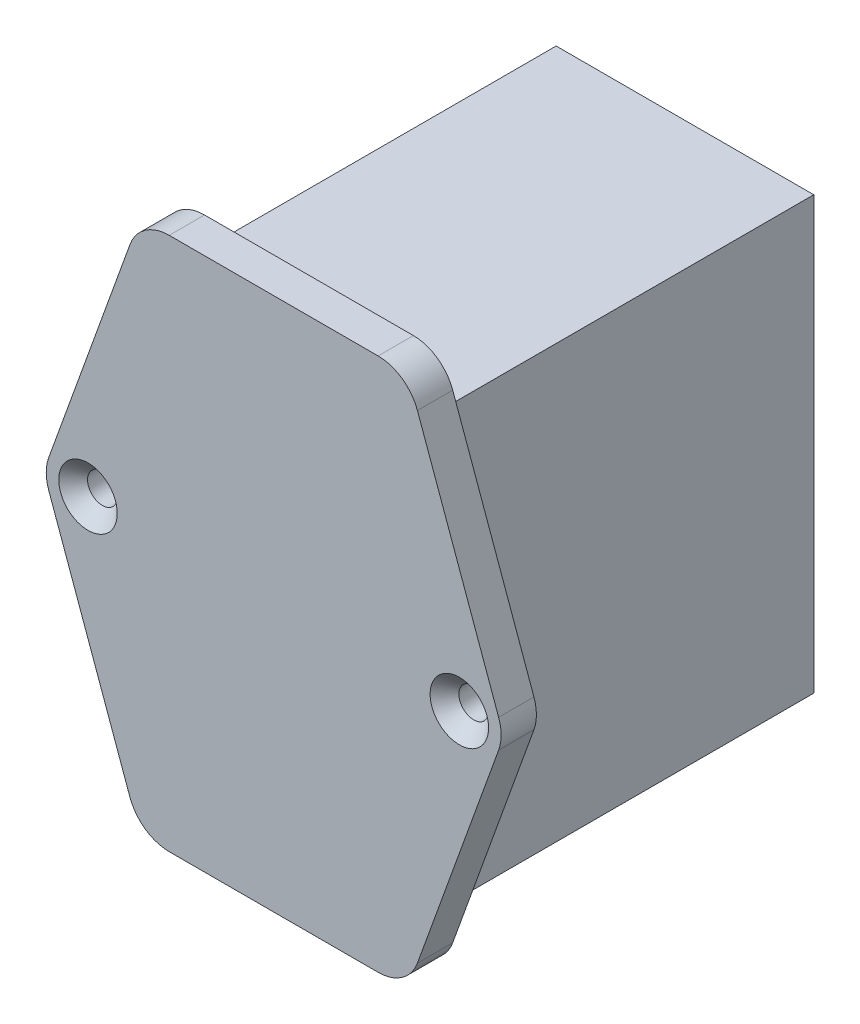
ISO-10303-21;
HEADER;
FILE_DESCRIPTION(('STEP AP214'),'2;1');
FILE_NAME('part.step','',(''),(''),'','','');
FILE_SCHEMA(('AUTOMOTIVE_DESIGN { 1 0 10303 214 1 1 1 1 }'));
ENDSEC;
DATA;
#1=APPLICATION_CONTEXT('core data for automotive mechanical design processes');
#2=APPLICATION_PROTOCOL_DEFINITION('international standard','automotive_design',2000,#1);
#3=PRODUCT_CONTEXT('',#1,'mechanical');
#4=PRODUCT('Part','Part','',(#3));
#5=PRODUCT_RELATED_PRODUCT_CATEGORY('part','',(#4));
#6=PRODUCT_DEFINITION_FORMATION('','',#4);
#7=PRODUCT_DEFINITION_CONTEXT('part definition',#1,'design');
#8=PRODUCT_DEFINITION('design','',#6,#7);
#9=PRODUCT_DEFINITION_SHAPE('','',#8);
#10=(LENGTH_UNIT() NAMED_UNIT(*) SI_UNIT(.MILLI.,.METRE.));
#11=(NAMED_UNIT(*) PLANE_ANGLE_UNIT() SI_UNIT($,.RADIAN.));
#12=(NAMED_UNIT(*) SI_UNIT($,.STERADIAN.) SOLID_ANGLE_UNIT());
#13=UNCERTAINTY_MEASURE_WITH_UNIT(LENGTH_MEASURE(1.E-05),#10,'distance_accuracy_value','');
#14=(GEOMETRIC_REPRESENTATION_CONTEXT(3) GLOBAL_UNCERTAINTY_ASSIGNED_CONTEXT((#13)) GLOBAL_UNIT_ASSIGNED_CONTEXT((#10,
#11,#12)) REPRESENTATION_CONTEXT('',''));
#15=CARTESIAN_POINT('',(0.,0.,0.));
#16=DIRECTION('',(0.,0.,1.));
#17=DIRECTION('',(1.,0.,0.));
#18=AXIS2_PLACEMENT_3D('',#15,#16,#17);
#19=CARTESIAN_POINT('',(-6.125,23.55,44.3));
#20=DIRECTION('',(0.,0.,-1.));
#21=DIRECTION('',(-1.,0.,0.));
#22=AXIS2_PLACEMENT_3D('',#19,#20,#21);
#23=CYLINDRICAL_SURFACE('',#22,1.6);
#24=CARTESIAN_POINT('',(-6.125,23.55,40.5));
#25=DIRECTION('',(0.,0.,1.));
#26=DIRECTION('',(1.,0.,0.));
#27=AXIS2_PLACEMENT_3D('',#24,#25,#26);
#28=CIRCLE('',#27,1.6);
#29=CARTESIAN_POINT('',(-4.525,23.55,40.5));
#30=VERTEX_POINT('',#29);
#31=EDGE_CURVE('E271',#30,#30,#28,.T.);
#32=ORIENTED_EDGE('',*,*,#31,.F.);
#33=EDGE_LOOP('',(#32));
#34=FACE_BOUND('',#33,.T.);
#35=CARTESIAN_POINT('',(-6.125,23.55,42.75));
#36=DIRECTION('',(0.,0.,1.));
#37=DIRECTION('',(1.,0.,0.));
#38=AXIS2_PLACEMENT_3D('',#35,#36,#37);
#39=CIRCLE('',#38,1.6);
#40=CARTESIAN_POINT('',(-4.525,23.55,42.75));
#41=VERTEX_POINT('',#40);
#42=EDGE_CURVE('E255',#41,#41,#39,.T.);
#43=ORIENTED_EDGE('',*,*,#42,.T.);
#44=EDGE_LOOP('',(#43));
#45=FACE_BOUND('',#44,.T.);
#46=ADVANCED_FACE('F35',(#34,#45),#23,.F.);
#47=CARTESIAN_POINT('',(0.,0.,40.5));
#48=DIRECTION('',(1.,0.,0.));
#49=DIRECTION('',(0.,0.,-1.));
#50=AXIS2_PLACEMENT_3D('',#47,#48,#49);
#51=PLANE('',#50);
#52=DIRECTION('',(0.,-1.,0.));
#53=VECTOR('',#52,1.);
#54=CARTESIAN_POINT('',(0.,0.,0.));
#55=LINE('',#54,#53);
#56=CARTESIAN_POINT('',(0.,46.5,0.));
#57=VERTEX_POINT('',#56);
#58=CARTESIAN_POINT('',(0.,0.,0.));
#59=VERTEX_POINT('',#58);
#60=EDGE_CURVE('E182',#57,#59,#55,.T.);
#61=ORIENTED_EDGE('',*,*,#60,.T.);
#62=DIRECTION('',(0.,0.,-1.));
#63=VECTOR('',#62,1.);
#64=CARTESIAN_POINT('',(0.,0.,40.5));
#65=LINE('',#64,#63);
#66=CARTESIAN_POINT('',(0.,0.,40.5));
#67=VERTEX_POINT('',#66);
#68=EDGE_CURVE('E11',#67,#59,#65,.T.);
#69=ORIENTED_EDGE('',*,*,#68,.F.);
#70=DIRECTION('',(0.,-1.,0.));
#71=VECTOR('',#70,1.);
#72=CARTESIAN_POINT('',(0.,0.,40.5));
#73=LINE('',#72,#71);
#74=CARTESIAN_POINT('',(0.,46.5,40.5));
#75=VERTEX_POINT('',#74);
#76=EDGE_CURVE('E191',#75,#67,#73,.T.);
#77=ORIENTED_EDGE('',*,*,#76,.F.);
#78=DIRECTION('',(0.,0.,-1.));
#79=VECTOR('',#78,1.);
#80=CARTESIAN_POINT('',(0.,46.5,40.5));
#81=LINE('',#80,#79);
#82=EDGE_CURVE('E200',#75,#57,#81,.T.);
#83=ORIENTED_EDGE('',*,*,#82,.T.);
#84=EDGE_LOOP('',(#61,#69,#77,#83));
#85=FACE_BOUND('',#84,.T.);
#86=ADVANCED_FACE('F37',(#85),#51,.F.);
#87=CARTESIAN_POINT('',(0.,0.,40.5));
#88=DIRECTION('',(0.,1.,0.));
#89=DIRECTION('',(0.,0.,1.));
#90=AXIS2_PLACEMENT_3D('',#87,#88,#89);
#91=PLANE('',#90);
#92=DIRECTION('',(1.,0.,0.));
#93=VECTOR('',#92,1.);
#94=CARTESIAN_POINT('',(0.,0.,0.));
#95=LINE('',#94,#93);
#96=CARTESIAN_POINT('',(27.75,0.,0.));
#97=VERTEX_POINT('',#96);
#98=EDGE_CURVE('E185',#59,#97,#95,.T.);
#99=ORIENTED_EDGE('',*,*,#98,.T.);
#100=DIRECTION('',(0.,0.,-1.));
#101=VECTOR('',#100,1.);
#102=CARTESIAN_POINT('',(27.75,0.,40.5));
#103=LINE('',#102,#101);
#104=CARTESIAN_POINT('',(27.75,0.,40.5));
#105=VERTEX_POINT('',#104);
#106=EDGE_CURVE('E44',#105,#97,#103,.T.);
#107=ORIENTED_EDGE('',*,*,#106,.F.);
#108=DIRECTION('',(1.,0.,0.));
#109=VECTOR('',#108,1.);
#110=CARTESIAN_POINT('',(0.,0.,40.5));
#111=LINE('',#110,#109);
#112=EDGE_CURVE('E78',#67,#105,#111,.T.);
#113=ORIENTED_EDGE('',*,*,#112,.F.);
#114=ORIENTED_EDGE('',*,*,#68,.T.);
#115=EDGE_LOOP('',(#99,#107,#113,#114));
#116=FACE_BOUND('',#115,.T.);
#117=ADVANCED_FACE('F234',(#116),#91,.F.);
#118=CARTESIAN_POINT('',(27.75,0.,40.5));
#119=DIRECTION('',(-1.,0.,0.));
#120=DIRECTION('',(0.,0.,1.));
#121=AXIS2_PLACEMENT_3D('',#118,#119,#120);
#122=PLANE('',#121);
#123=DIRECTION('',(0.,1.,0.));
#124=VECTOR('',#123,1.);
#125=CARTESIAN_POINT('',(27.75,0.,0.));
#126=LINE('',#125,#124);
#127=CARTESIAN_POINT('',(27.75,46.5,0.));
#128=VERTEX_POINT('',#127);
#129=EDGE_CURVE('E68',#97,#128,#126,.T.);
#130=ORIENTED_EDGE('',*,*,#129,.T.);
#131=DIRECTION('',(0.,0.,-1.));
#132=VECTOR('',#131,1.);
#133=CARTESIAN_POINT('',(27.75,46.5,40.5));
#134=LINE('',#133,#132);
#135=CARTESIAN_POINT('',(27.75,46.5,40.5));
#136=VERTEX_POINT('',#135);
#137=EDGE_CURVE('E52',#136,#128,#134,.T.);
#138=ORIENTED_EDGE('',*,*,#137,.F.);
#139=DIRECTION('',(0.,1.,0.));
#140=VECTOR('',#139,1.);
#141=CARTESIAN_POINT('',(27.75,0.,40.5));
#142=LINE('',#141,#140);
#143=EDGE_CURVE('E195',#105,#136,#142,.T.);
#144=ORIENTED_EDGE('',*,*,#143,.F.);
#145=ORIENTED_EDGE('',*,*,#106,.T.);
#146=EDGE_LOOP('',(#130,#138,#144,#145));
#147=FACE_BOUND('',#146,.T.);
#148=ADVANCED_FACE('F206',(#147),#122,.F.);
#149=CARTESIAN_POINT('',(0.,46.5,40.5));
#150=DIRECTION('',(0.,-1.,0.));
#151=DIRECTION('',(0.,0.,-1.));
#152=AXIS2_PLACEMENT_3D('',#149,#150,#151);
#153=PLANE('',#152);
#154=DIRECTION('',(-1.,0.,0.));
#155=VECTOR('',#154,1.);
#156=CARTESIAN_POINT('',(0.,46.5,0.));
#157=LINE('',#156,#155);
#158=EDGE_CURVE('E73',#128,#57,#157,.T.);
#159=ORIENTED_EDGE('',*,*,#158,.T.);
#160=ORIENTED_EDGE('',*,*,#82,.F.);
#161=DIRECTION('',(-1.,0.,0.));
#162=VECTOR('',#161,1.);
#163=CARTESIAN_POINT('',(0.,46.5,40.5));
#164=LINE('',#163,#162);
#165=EDGE_CURVE('E198',#136,#75,#164,.T.);
#166=ORIENTED_EDGE('',*,*,#165,.F.);
#167=ORIENTED_EDGE('',*,*,#137,.T.);
#168=EDGE_LOOP('',(#159,#160,#166,#167));
#169=FACE_BOUND('',#168,.T.);
#170=ADVANCED_FACE('F211',(#169),#153,.F.);
#171=CARTESIAN_POINT('',(0.,0.,0.));
#172=DIRECTION('',(0.,0.,-1.));
#173=DIRECTION('',(-1.,0.,0.));
#174=AXIS2_PLACEMENT_3D('',#171,#172,#173);
#175=PLANE('',#174);
#176=ORIENTED_EDGE('',*,*,#60,.F.);
#177=ORIENTED_EDGE('',*,*,#158,.F.);
#178=ORIENTED_EDGE('',*,*,#129,.F.);
#179=ORIENTED_EDGE('',*,*,#98,.F.);
#180=EDGE_LOOP('',(#176,#177,#178,#179));
#181=FACE_BOUND('',#180,.T.);
#182=ADVANCED_FACE('F209',(#181),#175,.T.);
#183=CARTESIAN_POINT('',(33.875,23.55,40.5));
#184=DIRECTION('',(0.,0.,1.));
#185=DIRECTION('',(1.,0.,0.));
#186=AXIS2_PLACEMENT_3D('',#183,#184,#185);
#187=PLANE('',#186);
#188=CARTESIAN_POINT('',(33.875,23.55,40.5));
#189=DIRECTION('',(0.,0.,1.));
#190=DIRECTION('',(1.,0.,0.));
#191=AXIS2_PLACEMENT_3D('',#188,#189,#190);
#192=CIRCLE('',#191,4.5);
#193=CARTESIAN_POINT('',(38.1078796435891,22.0226722935503,40.5));
#194=VERTEX_POINT('',#193);
#195=CARTESIAN_POINT('',(38.1078796435891,25.0773277064497,40.5));
#196=VERTEX_POINT('',#195);
#197=EDGE_CURVE('E181',#194,#196,#192,.T.);
#198=ORIENTED_EDGE('',*,*,#197,.F.);
#199=DIRECTION('',(0.339406156988818,0.940639920797582,0.));
#200=VECTOR('',#199,1.);
#201=CARTESIAN_POINT('',(29.3578796435891,-2.22732770644969,40.5));
#202=LINE('',#201,#200);
#203=CARTESIAN_POINT('',(29.3578796435891,-2.22732770644969,40.5));
#204=VERTEX_POINT('',#203);
#205=EDGE_CURVE('E177',#204,#194,#202,.T.);
#206=ORIENTED_EDGE('',*,*,#205,.F.);
#207=CARTESIAN_POINT('',(25.125,-0.700000000000004,40.5));
#208=DIRECTION('',(0.,0.,1.));
#209=DIRECTION('',(1.,0.,0.));
#210=AXIS2_PLACEMENT_3D('',#207,#208,#209);
#211=CIRCLE('',#210,4.5);
#212=CARTESIAN_POINT('',(25.125,-5.2,40.5));
#213=VERTEX_POINT('',#212);
#214=EDGE_CURVE('E312',#213,#204,#211,.T.);
#215=ORIENTED_EDGE('',*,*,#214,.F.);
#216=DIRECTION('',(1.,0.,0.));
#217=VECTOR('',#216,1.);
#218=CARTESIAN_POINT('',(2.625,-5.2,40.5));
#219=LINE('',#218,#217);
#220=CARTESIAN_POINT('',(2.625,-5.2,40.5));
#221=VERTEX_POINT('',#220);
#222=EDGE_CURVE('E310',#221,#213,#219,.T.);
#223=ORIENTED_EDGE('',*,*,#222,.F.);
#224=CARTESIAN_POINT('',(2.625,-0.700000000000004,40.5));
#225=DIRECTION('',(0.,0.,1.));
#226=DIRECTION('',(-1.,0.,0.));
#227=AXIS2_PLACEMENT_3D('',#224,#225,#226);
#228=CIRCLE('',#227,4.5);
#229=CARTESIAN_POINT('',(-1.60787964358912,-2.22732770644969,40.5));
#230=VERTEX_POINT('',#229);
#231=EDGE_CURVE('E308',#230,#221,#228,.T.);
#232=ORIENTED_EDGE('',*,*,#231,.F.);
#233=DIRECTION('',(0.339406156988818,-0.940639920797582,0.));
#234=VECTOR('',#233,1.);
#235=CARTESIAN_POINT('',(-10.3578796435891,22.0226722935503,40.5));
#236=LINE('',#235,#234);
#237=CARTESIAN_POINT('',(-10.3578796435891,22.0226722935503,40.5));
#238=VERTEX_POINT('',#237);
#239=EDGE_CURVE('E306',#238,#230,#236,.T.);
#240=ORIENTED_EDGE('',*,*,#239,.F.);
#241=CARTESIAN_POINT('',(-6.125,23.55,40.5));
#242=DIRECTION('',(0.,0.,1.));
#243=DIRECTION('',(1.,0.,0.));
#244=AXIS2_PLACEMENT_3D('',#241,#242,#243);
#245=CIRCLE('',#244,4.5);
#246=CARTESIAN_POINT('',(-10.3578796435891,25.0773277064497,40.5));
#247=VERTEX_POINT('',#246);
#248=EDGE_CURVE('E304',#247,#238,#245,.T.);
#249=ORIENTED_EDGE('',*,*,#248,.F.);
#250=DIRECTION('',(-0.339406156988818,-0.940639920797582,0.));
#251=VECTOR('',#250,1.);
#252=CARTESIAN_POINT('',(-1.60787964358912,49.3273277064497,40.5));
#253=LINE('',#252,#251);
#254=CARTESIAN_POINT('',(-1.60787964358912,49.3273277064497,40.5));
#255=VERTEX_POINT('',#254);
#256=EDGE_CURVE('E302',#255,#247,#253,.T.);
#257=ORIENTED_EDGE('',*,*,#256,.F.);
#258=CARTESIAN_POINT('',(2.625,47.8,40.5));
#259=DIRECTION('',(0.,0.,1.));
#260=DIRECTION('',(1.,0.,0.));
#261=AXIS2_PLACEMENT_3D('',#258,#259,#260);
#262=CIRCLE('',#261,4.5);
#263=CARTESIAN_POINT('',(2.625,52.3,40.5));
#264=VERTEX_POINT('',#263);
#265=EDGE_CURVE('E300',#264,#255,#262,.T.);
#266=ORIENTED_EDGE('',*,*,#265,.F.);
#267=DIRECTION('',(-1.,0.,0.));
#268=VECTOR('',#267,1.);
#269=CARTESIAN_POINT('',(25.125,52.3,40.5));
#270=LINE('',#269,#268);
#271=CARTESIAN_POINT('',(25.125,52.3,40.5));
#272=VERTEX_POINT('',#271);
#273=EDGE_CURVE('E298',#272,#264,#270,.T.);
#274=ORIENTED_EDGE('',*,*,#273,.F.);
#275=CARTESIAN_POINT('',(25.125,47.8,40.5));
#276=DIRECTION('',(0.,0.,1.));
#277=DIRECTION('',(-1.,0.,0.));
#278=AXIS2_PLACEMENT_3D('',#275,#276,#277);
#279=CIRCLE('',#278,4.5);
#280=CARTESIAN_POINT('',(29.3578796435891,49.3273277064497,40.5));
#281=VERTEX_POINT('',#280);
#282=EDGE_CURVE('E296',#281,#272,#279,.T.);
#283=ORIENTED_EDGE('',*,*,#282,.F.);
#284=DIRECTION('',(-0.339406156988818,0.940639920797582,0.));
#285=VECTOR('',#284,1.);
#286=CARTESIAN_POINT('',(38.1078796435891,25.0773277064497,40.5));
#287=LINE('',#286,#285);
#288=EDGE_CURVE('E294',#196,#281,#287,.T.);
#289=ORIENTED_EDGE('',*,*,#288,.F.);
#290=EDGE_LOOP('',(#198,#206,#215,#223,#232,#240,#249,#257,#266,#274,#283,#289));
#291=FACE_BOUND('',#290,.T.);
#292=ORIENTED_EDGE('',*,*,#31,.T.);
#293=EDGE_LOOP('',(#292));
#294=FACE_BOUND('',#293,.T.);
#295=CARTESIAN_POINT('',(33.875,23.55,40.5));
#296=DIRECTION('',(0.,0.,1.));
#297=DIRECTION('',(1.,0.,0.));
#298=AXIS2_PLACEMENT_3D('',#295,#296,#297);
#299=CIRCLE('',#298,1.6);
#300=CARTESIAN_POINT('',(35.475,23.55,40.5));
#301=VERTEX_POINT('',#300);
#302=EDGE_CURVE('E268',#301,#301,#299,.T.);
#303=ORIENTED_EDGE('',*,*,#302,.T.);
#304=EDGE_LOOP('',(#303));
#305=FACE_BOUND('',#304,.T.);
#306=ORIENTED_EDGE('',*,*,#165,.T.);
#307=ORIENTED_EDGE('',*,*,#76,.T.);
#308=ORIENTED_EDGE('',*,*,#112,.T.);
#309=ORIENTED_EDGE('',*,*,#143,.T.);
#310=EDGE_LOOP('',(#306,#307,#308,#309));
#311=FACE_BOUND('',#310,.T.);
#312=ADVANCED_FACE('F213',(#291,#294,#305,#311),#187,.F.);
#313=CARTESIAN_POINT('',(33.875,23.55,44.3));
#314=DIRECTION('',(0.,0.,1.));
#315=DIRECTION('',(1.,0.,0.));
#316=AXIS2_PLACEMENT_3D('',#313,#314,#315);
#317=PLANE('',#316);
#318=CARTESIAN_POINT('',(-6.125,23.55,44.3));
#319=DIRECTION('',(0.,0.,1.));
#320=DIRECTION('',(1.,0.,0.));
#321=AXIS2_PLACEMENT_3D('',#318,#319,#320);
#322=CIRCLE('',#321,3.15);
#323=CARTESIAN_POINT('',(-2.975,23.55,44.3));
#324=VERTEX_POINT('',#323);
#325=EDGE_CURVE('E258',#324,#324,#322,.T.);
#326=ORIENTED_EDGE('',*,*,#325,.F.);
#327=EDGE_LOOP('',(#326));
#328=FACE_BOUND('',#327,.T.);
#329=CARTESIAN_POINT('',(33.875,23.55,44.3));
#330=DIRECTION('',(0.,0.,1.));
#331=DIRECTION('',(1.,0.,0.));
#332=AXIS2_PLACEMENT_3D('',#329,#330,#331);
#333=CIRCLE('',#332,3.15);
#334=CARTESIAN_POINT('',(37.025,23.55,44.3));
#335=VERTEX_POINT('',#334);
#336=EDGE_CURVE('E260',#335,#335,#333,.T.);
#337=ORIENTED_EDGE('',*,*,#336,.F.);
#338=EDGE_LOOP('',(#337));
#339=FACE_BOUND('',#338,.T.);
#340=CARTESIAN_POINT('',(33.875,23.55,44.3));
#341=DIRECTION('',(0.,0.,1.));
#342=DIRECTION('',(1.,0.,0.));
#343=AXIS2_PLACEMENT_3D('',#340,#341,#342);
#344=CIRCLE('',#343,4.5);
#345=CARTESIAN_POINT('',(38.1078796435891,22.0226722935503,44.3));
#346=VERTEX_POINT('',#345);
#347=CARTESIAN_POINT('',(38.1078796435891,25.0773277064497,44.3));
#348=VERTEX_POINT('',#347);
#349=EDGE_CURVE('E168',#346,#348,#344,.T.);
#350=ORIENTED_EDGE('',*,*,#349,.T.);
#351=DIRECTION('',(-0.339406156988818,0.940639920797582,0.));
#352=VECTOR('',#351,1.);
#353=CARTESIAN_POINT('',(38.1078796435891,25.0773277064497,44.3));
#354=LINE('',#353,#352);
#355=CARTESIAN_POINT('',(29.3578796435891,49.3273277064497,44.3));
#356=VERTEX_POINT('',#355);
#357=EDGE_CURVE('E157',#348,#356,#354,.T.);
#358=ORIENTED_EDGE('',*,*,#357,.T.);
#359=CARTESIAN_POINT('',(25.125,47.8,44.3));
#360=DIRECTION('',(0.,0.,1.));
#361=DIRECTION('',(-1.,0.,0.));
#362=AXIS2_PLACEMENT_3D('',#359,#360,#361);
#363=CIRCLE('',#362,4.5);
#364=CARTESIAN_POINT('',(25.125,52.3,44.3));
#365=VERTEX_POINT('',#364);
#366=EDGE_CURVE('E167',#356,#365,#363,.T.);
#367=ORIENTED_EDGE('',*,*,#366,.T.);
#368=DIRECTION('',(-1.,0.,0.));
#369=VECTOR('',#368,1.);
#370=CARTESIAN_POINT('',(25.125,52.3,44.3));
#371=LINE('',#370,#369);
#372=CARTESIAN_POINT('',(2.625,52.3,44.3));
#373=VERTEX_POINT('',#372);
#374=EDGE_CURVE('E275',#365,#373,#371,.T.);
#375=ORIENTED_EDGE('',*,*,#374,.T.);
#376=CARTESIAN_POINT('',(2.625,47.8,44.3));
#377=DIRECTION('',(0.,0.,1.));
#378=DIRECTION('',(1.,0.,0.));
#379=AXIS2_PLACEMENT_3D('',#376,#377,#378);
#380=CIRCLE('',#379,4.5);
#381=CARTESIAN_POINT('',(-1.60787964358912,49.3273277064497,44.3));
#382=VERTEX_POINT('',#381);
#383=EDGE_CURVE('E277',#373,#382,#380,.T.);
#384=ORIENTED_EDGE('',*,*,#383,.T.);
#385=DIRECTION('',(-0.339406156988818,-0.940639920797582,0.));
#386=VECTOR('',#385,1.);
#387=CARTESIAN_POINT('',(-1.60787964358912,49.3273277064497,44.3));
#388=LINE('',#387,#386);
#389=CARTESIAN_POINT('',(-10.3578796435891,25.0773277064497,44.3));
#390=VERTEX_POINT('',#389);
#391=EDGE_CURVE('E279',#382,#390,#388,.T.);
#392=ORIENTED_EDGE('',*,*,#391,.T.);
#393=CARTESIAN_POINT('',(-6.125,23.55,44.3));
#394=DIRECTION('',(0.,0.,1.));
#395=DIRECTION('',(1.,0.,0.));
#396=AXIS2_PLACEMENT_3D('',#393,#394,#395);
#397=CIRCLE('',#396,4.5);
#398=CARTESIAN_POINT('',(-10.3578796435891,22.0226722935503,44.3));
#399=VERTEX_POINT('',#398);
#400=EDGE_CURVE('E281',#390,#399,#397,.T.);
#401=ORIENTED_EDGE('',*,*,#400,.T.);
#402=DIRECTION('',(0.339406156988818,-0.940639920797582,0.));
#403=VECTOR('',#402,1.);
#404=CARTESIAN_POINT('',(-10.3578796435891,22.0226722935503,44.3));
#405=LINE('',#404,#403);
#406=CARTESIAN_POINT('',(-1.60787964358912,-2.22732770644969,44.3));
#407=VERTEX_POINT('',#406);
#408=EDGE_CURVE('E283',#399,#407,#405,.T.);
#409=ORIENTED_EDGE('',*,*,#408,.T.);
#410=CARTESIAN_POINT('',(2.625,-0.700000000000004,44.3));
#411=DIRECTION('',(0.,0.,1.));
#412=DIRECTION('',(-1.,0.,0.));
#413=AXIS2_PLACEMENT_3D('',#410,#411,#412);
#414=CIRCLE('',#413,4.5);
#415=CARTESIAN_POINT('',(2.625,-5.2,44.3));
#416=VERTEX_POINT('',#415);
#417=EDGE_CURVE('E285',#407,#416,#414,.T.);
#418=ORIENTED_EDGE('',*,*,#417,.T.);
#419=DIRECTION('',(1.,0.,0.));
#420=VECTOR('',#419,1.);
#421=CARTESIAN_POINT('',(2.625,-5.2,44.3));
#422=LINE('',#421,#420);
#423=CARTESIAN_POINT('',(25.125,-5.2,44.3));
#424=VERTEX_POINT('',#423);
#425=EDGE_CURVE('E287',#416,#424,#422,.T.);
#426=ORIENTED_EDGE('',*,*,#425,.T.);
#427=CARTESIAN_POINT('',(25.125,-0.700000000000004,44.3));
#428=DIRECTION('',(0.,0.,1.));
#429=DIRECTION('',(1.,0.,0.));
#430=AXIS2_PLACEMENT_3D('',#427,#428,#429);
#431=CIRCLE('',#430,4.5);
#432=CARTESIAN_POINT('',(29.3578796435891,-2.22732770644969,44.3));
#433=VERTEX_POINT('',#432);
#434=EDGE_CURVE('E289',#424,#433,#431,.T.);
#435=ORIENTED_EDGE('',*,*,#434,.T.);
#436=DIRECTION('',(0.339406156988818,0.940639920797582,0.));
#437=VECTOR('',#436,1.);
#438=CARTESIAN_POINT('',(29.3578796435891,-2.22732770644969,44.3));
#439=LINE('',#438,#437);
#440=EDGE_CURVE('E173',#433,#346,#439,.T.);
#441=ORIENTED_EDGE('',*,*,#440,.T.);
#442=EDGE_LOOP('',(#350,#358,#367,#375,#384,#392,#401,#409,#418,#426,#435,#441));
#443=FACE_BOUND('',#442,.T.);
#444=ADVANCED_FACE('F171',(#328,#339,#443),#317,.T.);
#445=CARTESIAN_POINT('',(33.875,23.55,44.3));
#446=DIRECTION('',(0.,0.,-1.));
#447=DIRECTION('',(-1.,0.,0.));
#448=AXIS2_PLACEMENT_3D('',#445,#446,#447);
#449=CYLINDRICAL_SURFACE('',#448,4.5);
#450=ORIENTED_EDGE('',*,*,#197,.T.);
#451=DIRECTION('',(0.,0.,-1.));
#452=VECTOR('',#451,1.);
#453=CARTESIAN_POINT('',(38.1078796435891,25.0773277064497,44.3));
#454=LINE('',#453,#452);
#455=EDGE_CURVE('E161',#348,#196,#454,.T.);
#456=ORIENTED_EDGE('',*,*,#455,.F.);
#457=ORIENTED_EDGE('',*,*,#349,.F.);
#458=DIRECTION('',(0.,0.,-1.));
#459=VECTOR('',#458,1.);
#460=CARTESIAN_POINT('',(38.1078796435891,22.0226722935503,44.3));
#461=LINE('',#460,#459);
#462=EDGE_CURVE('E292',#346,#194,#461,.T.);
#463=ORIENTED_EDGE('',*,*,#462,.T.);
#464=EDGE_LOOP('',(#450,#456,#457,#463));
#465=FACE_BOUND('',#464,.T.);
#466=ADVANCED_FACE('F179',(#465),#449,.T.);
#467=CARTESIAN_POINT('',(38.1078796435891,25.0773277064497,44.3));
#468=DIRECTION('',(-0.940639920797582,-0.339406156988818,0.));
#469=DIRECTION('',(0.339406156988818,-0.940639920797582,0.));
#470=AXIS2_PLACEMENT_3D('',#467,#468,#469);
#471=PLANE('',#470);
#472=ORIENTED_EDGE('',*,*,#288,.T.);
#473=DIRECTION('',(0.,0.,-1.));
#474=VECTOR('',#473,1.);
#475=CARTESIAN_POINT('',(29.3578796435891,49.3273277064497,44.3));
#476=LINE('',#475,#474);
#477=EDGE_CURVE('E164',#356,#281,#476,.T.);
#478=ORIENTED_EDGE('',*,*,#477,.F.);
#479=ORIENTED_EDGE('',*,*,#357,.F.);
#480=ORIENTED_EDGE('',*,*,#455,.T.);
#481=EDGE_LOOP('',(#472,#478,#479,#480));
#482=FACE_BOUND('',#481,.T.);
#483=ADVANCED_FACE('F159',(#482),#471,.F.);
#484=CARTESIAN_POINT('',(25.125,47.8,44.3));
#485=DIRECTION('',(0.,0.,-1.));
#486=DIRECTION('',(-1.,0.,0.));
#487=AXIS2_PLACEMENT_3D('',#484,#485,#486);
#488=CYLINDRICAL_SURFACE('',#487,4.5);
#489=ORIENTED_EDGE('',*,*,#282,.T.);
#490=DIRECTION('',(0.,0.,-1.));
#491=VECTOR('',#490,1.);
#492=CARTESIAN_POINT('',(25.125,52.3,44.3));
#493=LINE('',#492,#491);
#494=EDGE_CURVE('E187',#365,#272,#493,.T.);
#495=ORIENTED_EDGE('',*,*,#494,.F.);
#496=ORIENTED_EDGE('',*,*,#366,.F.);
#497=ORIENTED_EDGE('',*,*,#477,.T.);
#498=EDGE_LOOP('',(#489,#495,#496,#497));
#499=FACE_BOUND('',#498,.T.);
#500=ADVANCED_FACE('F361',(#499),#488,.T.);
#501=CARTESIAN_POINT('',(25.125,52.3,44.3));
#502=DIRECTION('',(0.,-1.,0.));
#503=DIRECTION('',(1.,0.,0.));
#504=AXIS2_PLACEMENT_3D('',#501,#502,#503);
#505=PLANE('',#504);
#506=ORIENTED_EDGE('',*,*,#273,.T.);
#507=DIRECTION('',(0.,0.,-1.));
#508=VECTOR('',#507,1.);
#509=CARTESIAN_POINT('',(2.625,52.3,44.3));
#510=LINE('',#509,#508);
#511=EDGE_CURVE('E337',#373,#264,#510,.T.);
#512=ORIENTED_EDGE('',*,*,#511,.F.);
#513=ORIENTED_EDGE('',*,*,#374,.F.);
#514=ORIENTED_EDGE('',*,*,#494,.T.);
#515=EDGE_LOOP('',(#506,#512,#513,#514));
#516=FACE_BOUND('',#515,.T.);
#517=ADVANCED_FACE('F344',(#516),#505,.F.);
#518=CARTESIAN_POINT('',(2.625,47.8,44.3));
#519=DIRECTION('',(0.,0.,-1.));
#520=DIRECTION('',(-1.,0.,0.));
#521=AXIS2_PLACEMENT_3D('',#518,#519,#520);
#522=CYLINDRICAL_SURFACE('',#521,4.5);
#523=ORIENTED_EDGE('',*,*,#265,.T.);
#524=DIRECTION('',(0.,0.,-1.));
#525=VECTOR('',#524,1.);
#526=CARTESIAN_POINT('',(-1.60787964358912,49.3273277064497,44.3));
#527=LINE('',#526,#525);
#528=EDGE_CURVE('E334',#382,#255,#527,.T.);
#529=ORIENTED_EDGE('',*,*,#528,.F.);
#530=ORIENTED_EDGE('',*,*,#383,.F.);
#531=ORIENTED_EDGE('',*,*,#511,.T.);
#532=EDGE_LOOP('',(#523,#529,#530,#531));
#533=FACE_BOUND('',#532,.T.);
#534=ADVANCED_FACE('F353',(#533),#522,.T.);
#535=CARTESIAN_POINT('',(-1.60787964358912,49.3273277064497,44.3));
#536=DIRECTION('',(0.940639920797582,-0.339406156988818,0.));
#537=DIRECTION('',(0.339406156988818,0.940639920797582,0.));
#538=AXIS2_PLACEMENT_3D('',#535,#536,#537);
#539=PLANE('',#538);
#540=ORIENTED_EDGE('',*,*,#256,.T.);
#541=DIRECTION('',(0.,0.,-1.));
#542=VECTOR('',#541,1.);
#543=CARTESIAN_POINT('',(-10.3578796435891,25.0773277064497,44.3));
#544=LINE('',#543,#542);
#545=EDGE_CURVE('E331',#390,#247,#544,.T.);
#546=ORIENTED_EDGE('',*,*,#545,.F.);
#547=ORIENTED_EDGE('',*,*,#391,.F.);
#548=ORIENTED_EDGE('',*,*,#528,.T.);
#549=EDGE_LOOP('',(#540,#546,#547,#548));
#550=FACE_BOUND('',#549,.T.);
#551=ADVANCED_FACE('F357',(#550),#539,.F.);
#552=CARTESIAN_POINT('',(-6.125,23.55,44.3));
#553=DIRECTION('',(0.,0.,-1.));
#554=DIRECTION('',(-1.,0.,0.));
#555=AXIS2_PLACEMENT_3D('',#552,#553,#554);
#556=CYLINDRICAL_SURFACE('',#555,4.5);
#557=ORIENTED_EDGE('',*,*,#248,.T.);
#558=DIRECTION('',(0.,0.,-1.));
#559=VECTOR('',#558,1.);
#560=CARTESIAN_POINT('',(-10.3578796435891,22.0226722935503,44.3));
#561=LINE('',#560,#559);
#562=EDGE_CURVE('E328',#399,#238,#561,.T.);
#563=ORIENTED_EDGE('',*,*,#562,.F.);
#564=ORIENTED_EDGE('',*,*,#400,.F.);
#565=ORIENTED_EDGE('',*,*,#545,.T.);
#566=EDGE_LOOP('',(#557,#563,#564,#565));
#567=FACE_BOUND('',#566,.T.);
#568=ADVANCED_FACE('F447',(#567),#556,.T.);
#569=CARTESIAN_POINT('',(-10.3578796435891,22.0226722935503,44.3));
#570=DIRECTION('',(0.940639920797582,0.339406156988818,0.));
#571=DIRECTION('',(-0.339406156988818,0.940639920797582,0.));
#572=AXIS2_PLACEMENT_3D('',#569,#570,#571);
#573=PLANE('',#572);
#574=ORIENTED_EDGE('',*,*,#239,.T.);
#575=DIRECTION('',(0.,0.,-1.));
#576=VECTOR('',#575,1.);
#577=CARTESIAN_POINT('',(-1.60787964358912,-2.22732770644969,44.3));
#578=LINE('',#577,#576);
#579=EDGE_CURVE('E325',#407,#230,#578,.T.);
#580=ORIENTED_EDGE('',*,*,#579,.F.);
#581=ORIENTED_EDGE('',*,*,#408,.F.);
#582=ORIENTED_EDGE('',*,*,#562,.T.);
#583=EDGE_LOOP('',(#574,#580,#581,#582));
#584=FACE_BOUND('',#583,.T.);
#585=ADVANCED_FACE('F455',(#584),#573,.F.);
#586=CARTESIAN_POINT('',(2.625,-0.700000000000004,44.3));
#587=DIRECTION('',(0.,0.,-1.));
#588=DIRECTION('',(-1.,0.,0.));
#589=AXIS2_PLACEMENT_3D('',#586,#587,#588);
#590=CYLINDRICAL_SURFACE('',#589,4.5);
#591=ORIENTED_EDGE('',*,*,#231,.T.);
#592=DIRECTION('',(0.,0.,-1.));
#593=VECTOR('',#592,1.);
#594=CARTESIAN_POINT('',(2.625,-5.2,44.3));
#595=LINE('',#594,#593);
#596=EDGE_CURVE('E322',#416,#221,#595,.T.);
#597=ORIENTED_EDGE('',*,*,#596,.F.);
#598=ORIENTED_EDGE('',*,*,#417,.F.);
#599=ORIENTED_EDGE('',*,*,#579,.T.);
#600=EDGE_LOOP('',(#591,#597,#598,#599));
#601=FACE_BOUND('',#600,.T.);
#602=ADVANCED_FACE('F464',(#601),#590,.T.);
#603=CARTESIAN_POINT('',(2.625,-5.2,44.3));
#604=DIRECTION('',(0.,1.,0.));
#605=DIRECTION('',(-1.,0.,0.));
#606=AXIS2_PLACEMENT_3D('',#603,#604,#605);
#607=PLANE('',#606);
#608=ORIENTED_EDGE('',*,*,#222,.T.);
#609=DIRECTION('',(0.,0.,-1.));
#610=VECTOR('',#609,1.);
#611=CARTESIAN_POINT('',(25.125,-5.2,44.3));
#612=LINE('',#611,#610);
#613=EDGE_CURVE('E319',#424,#213,#612,.T.);
#614=ORIENTED_EDGE('',*,*,#613,.F.);
#615=ORIENTED_EDGE('',*,*,#425,.F.);
#616=ORIENTED_EDGE('',*,*,#596,.T.);
#617=EDGE_LOOP('',(#608,#614,#615,#616));
#618=FACE_BOUND('',#617,.T.);
#619=ADVANCED_FACE('F473',(#618),#607,.F.);
#620=CARTESIAN_POINT('',(25.125,-0.700000000000004,44.3));
#621=DIRECTION('',(0.,0.,-1.));
#622=DIRECTION('',(-1.,0.,0.));
#623=AXIS2_PLACEMENT_3D('',#620,#621,#622);
#624=CYLINDRICAL_SURFACE('',#623,4.5);
#625=ORIENTED_EDGE('',*,*,#214,.T.);
#626=DIRECTION('',(0.,0.,-1.));
#627=VECTOR('',#626,1.);
#628=CARTESIAN_POINT('',(29.3578796435891,-2.22732770644969,44.3));
#629=LINE('',#628,#627);
#630=EDGE_CURVE('E316',#433,#204,#629,.T.);
#631=ORIENTED_EDGE('',*,*,#630,.F.);
#632=ORIENTED_EDGE('',*,*,#434,.F.);
#633=ORIENTED_EDGE('',*,*,#613,.T.);
#634=EDGE_LOOP('',(#625,#631,#632,#633));
#635=FACE_BOUND('',#634,.T.);
#636=ADVANCED_FACE('F482',(#635),#624,.T.);
#637=CARTESIAN_POINT('',(29.3578796435891,-2.22732770644969,44.3));
#638=DIRECTION('',(-0.940639920797582,0.339406156988818,0.));
#639=DIRECTION('',(-0.339406156988818,-0.940639920797582,0.));
#640=AXIS2_PLACEMENT_3D('',#637,#638,#639);
#641=PLANE('',#640);
#642=ORIENTED_EDGE('',*,*,#205,.T.);
#643=ORIENTED_EDGE('',*,*,#462,.F.);
#644=ORIENTED_EDGE('',*,*,#440,.F.);
#645=ORIENTED_EDGE('',*,*,#630,.T.);
#646=EDGE_LOOP('',(#642,#643,#644,#645));
#647=FACE_BOUND('',#646,.T.);
#648=ADVANCED_FACE('F242',(#647),#641,.F.);
#649=CARTESIAN_POINT('',(33.875,23.55,44.3));
#650=DIRECTION('',(0.,0.,-1.));
#651=DIRECTION('',(-1.,0.,0.));
#652=AXIS2_PLACEMENT_3D('',#649,#650,#651);
#653=CYLINDRICAL_SURFACE('',#652,1.6);
#654=CARTESIAN_POINT('',(33.875,23.55,42.75));
#655=DIRECTION('',(0.,0.,1.));
#656=DIRECTION('',(1.,0.,0.));
#657=AXIS2_PLACEMENT_3D('',#654,#655,#656);
#658=CIRCLE('',#657,1.6);
#659=CARTESIAN_POINT('',(35.475,23.55,42.75));
#660=VERTEX_POINT('',#659);
#661=EDGE_CURVE('E265',#660,#660,#658,.T.);
#662=ORIENTED_EDGE('',*,*,#661,.T.);
#663=EDGE_LOOP('',(#662));
#664=FACE_BOUND('',#663,.T.);
#665=ORIENTED_EDGE('',*,*,#302,.F.);
#666=EDGE_LOOP('',(#665));
#667=FACE_BOUND('',#666,.T.);
#668=ADVANCED_FACE('F238',(#664,#667),#653,.F.);
#669=CARTESIAN_POINT('',(33.875,23.55,44.3));
#670=DIRECTION('',(0.,0.,1.));
#671=DIRECTION('',(1.,0.,0.));
#672=AXIS2_PLACEMENT_3D('',#669,#670,#671);
#673=CONICAL_SURFACE('',#672,3.15,0.785398163397448);
#674=ORIENTED_EDGE('',*,*,#661,.F.);
#675=EDGE_LOOP('',(#674));
#676=FACE_BOUND('',#675,.T.);
#677=ORIENTED_EDGE('',*,*,#336,.T.);
#678=EDGE_LOOP('',(#677));
#679=FACE_BOUND('',#678,.T.);
#680=ADVANCED_FACE('F241',(#676,#679),#673,.F.);
#681=CARTESIAN_POINT('',(-6.125,23.55,44.3));
#682=DIRECTION('',(0.,0.,1.));
#683=DIRECTION('',(1.,0.,0.));
#684=AXIS2_PLACEMENT_3D('',#681,#682,#683);
#685=CONICAL_SURFACE('',#684,3.15,0.785398163397447);
#686=ORIENTED_EDGE('',*,*,#42,.F.);
#687=EDGE_LOOP('',(#686));
#688=FACE_BOUND('',#687,.T.);
#689=ORIENTED_EDGE('',*,*,#325,.T.);
#690=EDGE_LOOP('',(#689));
#691=FACE_BOUND('',#690,.T.);
#692=ADVANCED_FACE('F246',(#688,#691),#685,.F.);
#693=CLOSED_SHELL('',(#46,#86,#117,#148,#170,#182,#312,#444,#466,#483,#500,#517,#534,#551,#568,
#585,#602,#619,#636,#648,#668,#680,#692));
#694=MANIFOLD_SOLID_BREP('B2',#693);
#695=ADVANCED_BREP_SHAPE_REPRESENTATION('',(#18,#694),#14);
#696=SHAPE_DEFINITION_REPRESENTATION(#9,#695);
ENDSEC;
END-ISO-10303-21;
